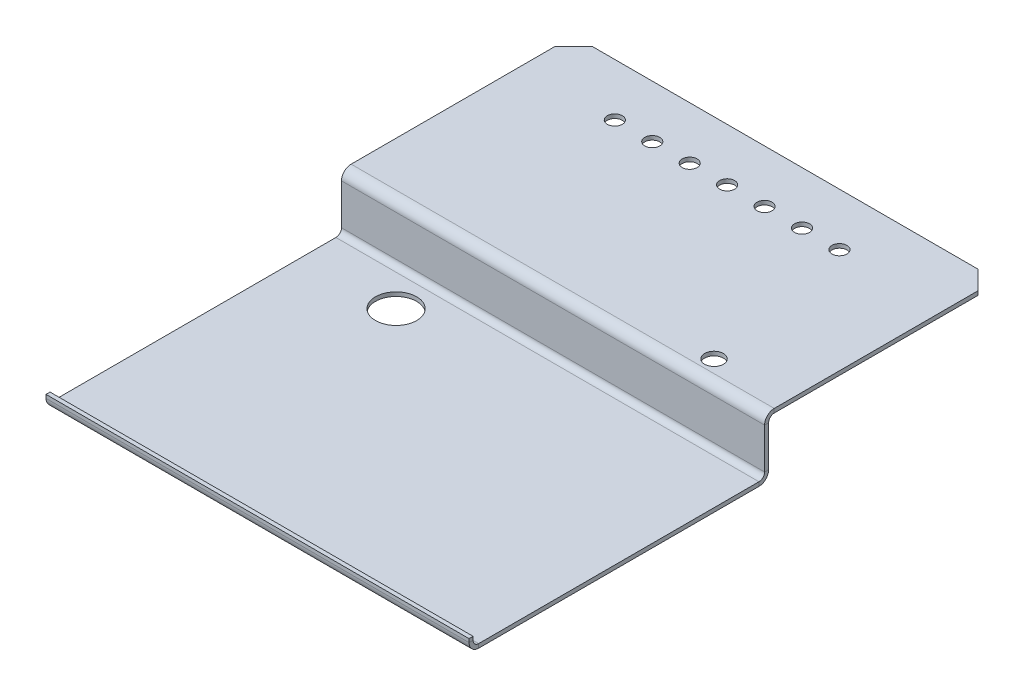
ISO-10303-21;
HEADER;
FILE_DESCRIPTION(('STEP AP214'),'2;1');
FILE_NAME('part.step','',(''),(''),'','','');
FILE_SCHEMA(('AUTOMOTIVE_DESIGN { 1 0 10303 214 1 1 1 1 }'));
ENDSEC;
DATA;
#1=APPLICATION_CONTEXT('core data for automotive mechanical design processes');
#2=APPLICATION_PROTOCOL_DEFINITION('international standard','automotive_design',2000,#1);
#3=PRODUCT_CONTEXT('',#1,'mechanical');
#4=PRODUCT('Part','Part','',(#3));
#5=PRODUCT_RELATED_PRODUCT_CATEGORY('part','',(#4));
#6=PRODUCT_DEFINITION_FORMATION('','',#4);
#7=PRODUCT_DEFINITION_CONTEXT('part definition',#1,'design');
#8=PRODUCT_DEFINITION('design','',#6,#7);
#9=PRODUCT_DEFINITION_SHAPE('','',#8);
#10=(LENGTH_UNIT() NAMED_UNIT(*) SI_UNIT(.MILLI.,.METRE.));
#11=(NAMED_UNIT(*) PLANE_ANGLE_UNIT() SI_UNIT($,.RADIAN.));
#12=(NAMED_UNIT(*) SI_UNIT($,.STERADIAN.) SOLID_ANGLE_UNIT());
#13=UNCERTAINTY_MEASURE_WITH_UNIT(LENGTH_MEASURE(1.E-05),#10,'distance_accuracy_value','');
#14=(GEOMETRIC_REPRESENTATION_CONTEXT(3) GLOBAL_UNCERTAINTY_ASSIGNED_CONTEXT((#13)) GLOBAL_UNIT_ASSIGNED_CONTEXT((#10,
#11,#12)) REPRESENTATION_CONTEXT('',''));
#15=CARTESIAN_POINT('',(0.,0.,0.));
#16=DIRECTION('',(0.,0.,1.));
#17=DIRECTION('',(1.,0.,0.));
#18=AXIS2_PLACEMENT_3D('',#15,#16,#17);
#19=CARTESIAN_POINT('',(113.,-29.85,219.85));
#20=DIRECTION('',(-1.,0.,0.));
#21=DIRECTION('',(0.,0.,1.));
#22=AXIS2_PLACEMENT_3D('',#19,#20,#21);
#23=PLANE('',#22);
#24=DIRECTION('',(0.,-1.,0.));
#25=VECTOR('',#24,1.);
#26=CARTESIAN_POINT('',(113.,-27.7,214.7));
#27=LINE('',#26,#25);
#28=CARTESIAN_POINT('',(113.,-27.7,214.7));
#29=VERTEX_POINT('',#28);
#30=CARTESIAN_POINT('',(113.,-29.85,214.7));
#31=VERTEX_POINT('',#30);
#32=EDGE_CURVE('E275',#29,#31,#27,.T.);
#33=ORIENTED_EDGE('',*,*,#32,.T.);
#34=DIRECTION('',(0.,0.,1.));
#35=VECTOR('',#34,1.);
#36=CARTESIAN_POINT('',(113.,-29.85,0.));
#37=LINE('',#36,#35);
#38=CARTESIAN_POINT('',(113.,-29.85,65.0000000000001));
#39=VERTEX_POINT('',#38);
#40=EDGE_CURVE('E294',#39,#31,#37,.T.);
#41=ORIENTED_EDGE('',*,*,#40,.F.);
#42=DIRECTION('',(0.,1.,0.));
#43=VECTOR('',#42,1.);
#44=CARTESIAN_POINT('',(113.,-27.7,65.0000000000001));
#45=LINE('',#44,#43);
#46=CARTESIAN_POINT('',(113.,-27.7,65.0000000000001));
#47=VERTEX_POINT('',#46);
#48=EDGE_CURVE('E302',#47,#39,#45,.F.);
#49=ORIENTED_EDGE('',*,*,#48,.F.);
#50=DIRECTION('',(0.,0.,-1.));
#51=VECTOR('',#50,1.);
#52=CARTESIAN_POINT('',(113.,-27.7,219.85));
#53=LINE('',#52,#51);
#54=EDGE_CURVE('E298',#47,#29,#53,.F.);
#55=ORIENTED_EDGE('',*,*,#54,.T.);
#56=EDGE_LOOP('',(#33,#41,#49,#55));
#57=FACE_BOUND('',#56,.T.);
#58=ADVANCED_FACE('F96',(#57),#23,.F.);
#59=CARTESIAN_POINT('',(-113.,-29.85,62.0000000000001));
#60=DIRECTION('',(1.,0.,0.));
#61=DIRECTION('',(0.,0.,-1.));
#62=AXIS2_PLACEMENT_3D('',#59,#60,#61);
#63=PLANE('',#62);
#64=DIRECTION('',(0.,-1.,0.));
#65=VECTOR('',#64,1.);
#66=CARTESIAN_POINT('',(-113.,-27.7,214.7));
#67=LINE('',#66,#65);
#68=CARTESIAN_POINT('',(-113.,-27.7,214.7));
#69=VERTEX_POINT('',#68);
#70=CARTESIAN_POINT('',(-113.,-29.85,214.7));
#71=VERTEX_POINT('',#70);
#72=EDGE_CURVE('E285',#69,#71,#67,.T.);
#73=ORIENTED_EDGE('',*,*,#72,.F.);
#74=DIRECTION('',(0.,0.,1.));
#75=VECTOR('',#74,1.);
#76=CARTESIAN_POINT('',(-113.,-27.7,62.0000000000001));
#77=LINE('',#76,#75);
#78=CARTESIAN_POINT('',(-113.,-27.7,65.0000000000001));
#79=VERTEX_POINT('',#78);
#80=EDGE_CURVE('E296',#69,#79,#77,.F.);
#81=ORIENTED_EDGE('',*,*,#80,.T.);
#82=DIRECTION('',(0.,1.,0.));
#83=VECTOR('',#82,1.);
#84=CARTESIAN_POINT('',(-113.,-29.85,65.0000000000001));
#85=LINE('',#84,#83);
#86=CARTESIAN_POINT('',(-113.,-29.85,65.0000000000001));
#87=VERTEX_POINT('',#86);
#88=EDGE_CURVE('E288',#79,#87,#85,.F.);
#89=ORIENTED_EDGE('',*,*,#88,.T.);
#90=DIRECTION('',(0.,0.,-1.));
#91=VECTOR('',#90,1.);
#92=CARTESIAN_POINT('',(-113.,-29.85,0.));
#93=LINE('',#92,#91);
#94=EDGE_CURVE('E291',#71,#87,#93,.T.);
#95=ORIENTED_EDGE('',*,*,#94,.F.);
#96=EDGE_LOOP('',(#73,#81,#89,#95));
#97=FACE_BOUND('',#96,.T.);
#98=ADVANCED_FACE('F463',(#97),#63,.F.);
#99=CARTESIAN_POINT('',(0.,-29.85,0.));
#100=DIRECTION('',(0.,1.,0.));
#101=DIRECTION('',(0.,0.,1.));
#102=AXIS2_PLACEMENT_3D('',#99,#100,#101);
#103=PLANE('',#102);
#104=CARTESIAN_POINT('',(-64.,-29.85,81.8500000000001));
#105=DIRECTION('',(0.,-1.,0.));
#106=DIRECTION('',(0.,0.,-1.));
#107=AXIS2_PLACEMENT_3D('',#104,#105,#106);
#108=CIRCLE('',#107,11.);
#109=CARTESIAN_POINT('',(-64.,-29.85,70.8500000000001));
#110=VERTEX_POINT('',#109);
#111=EDGE_CURVE('E404',#110,#110,#108,.T.);
#112=ORIENTED_EDGE('',*,*,#111,.F.);
#113=EDGE_LOOP('',(#112));
#114=FACE_BOUND('',#113,.T.);
#115=DIRECTION('',(1.,0.,0.));
#116=VECTOR('',#115,1.);
#117=CARTESIAN_POINT('',(113.,-29.85,214.7));
#118=LINE('',#117,#116);
#119=EDGE_CURVE('E269',#31,#71,#118,.F.);
#120=ORIENTED_EDGE('',*,*,#119,.T.);
#121=ORIENTED_EDGE('',*,*,#94,.T.);
#122=DIRECTION('',(1.,0.,0.));
#123=VECTOR('',#122,1.);
#124=CARTESIAN_POINT('',(-113.,-29.85,65.0000000000001));
#125=LINE('',#124,#123);
#126=EDGE_CURVE('E300',#39,#87,#125,.F.);
#127=ORIENTED_EDGE('',*,*,#126,.F.);
#128=ORIENTED_EDGE('',*,*,#40,.T.);
#129=EDGE_LOOP('',(#120,#121,#127,#128));
#130=FACE_BOUND('',#129,.T.);
#131=ADVANCED_FACE('F469',(#114,#130),#103,.F.);
#132=CARTESIAN_POINT('',(0.,-27.7,0.));
#133=DIRECTION('',(0.,1.,0.));
#134=DIRECTION('',(0.,0.,1.));
#135=AXIS2_PLACEMENT_3D('',#132,#133,#134);
#136=PLANE('',#135);
#137=CARTESIAN_POINT('',(-64.,-27.7,81.8500000000001));
#138=DIRECTION('',(0.,1.,0.));
#139=DIRECTION('',(0.,0.,1.));
#140=AXIS2_PLACEMENT_3D('',#137,#138,#139);
#141=CIRCLE('',#140,11.);
#142=CARTESIAN_POINT('',(-64.,-27.7,92.8500000000001));
#143=VERTEX_POINT('',#142);
#144=EDGE_CURVE('E268',#143,#143,#141,.T.);
#145=ORIENTED_EDGE('',*,*,#144,.F.);
#146=EDGE_LOOP('',(#145));
#147=FACE_BOUND('',#146,.T.);
#148=ORIENTED_EDGE('',*,*,#80,.F.);
#149=DIRECTION('',(1.,0.,0.));
#150=VECTOR('',#149,1.);
#151=CARTESIAN_POINT('',(113.,-27.7,214.7));
#152=LINE('',#151,#150);
#153=EDGE_CURVE('E113',#29,#69,#152,.F.);
#154=ORIENTED_EDGE('',*,*,#153,.F.);
#155=ORIENTED_EDGE('',*,*,#54,.F.);
#156=DIRECTION('',(1.,0.,0.));
#157=VECTOR('',#156,1.);
#158=CARTESIAN_POINT('',(-113.,-27.7,65.0000000000001));
#159=LINE('',#158,#157);
#160=EDGE_CURVE('E305',#79,#47,#159,.T.);
#161=ORIENTED_EDGE('',*,*,#160,.F.);
#162=EDGE_LOOP('',(#148,#154,#155,#161));
#163=FACE_BOUND('',#162,.T.);
#164=ADVANCED_FACE('F507',(#147,#163),#136,.T.);
#165=CARTESIAN_POINT('',(113.,0.,62.));
#166=DIRECTION('',(-1.,0.,0.));
#167=DIRECTION('',(0.,0.,1.));
#168=AXIS2_PLACEMENT_3D('',#165,#166,#167);
#169=PLANE('',#168);
#170=DIRECTION('',(0.,0.,-1.));
#171=VECTOR('',#170,1.);
#172=CARTESIAN_POINT('',(113.,-24.7,62.0000000000001));
#173=LINE('',#172,#171);
#174=CARTESIAN_POINT('',(113.,-24.7,62.0000000000001));
#175=VERTEX_POINT('',#174);
#176=CARTESIAN_POINT('',(113.,-24.7,59.8500000000001));
#177=VERTEX_POINT('',#176);
#178=EDGE_CURVE('E314',#175,#177,#173,.T.);
#179=ORIENTED_EDGE('',*,*,#178,.T.);
#180=DIRECTION('',(0.,-1.,0.));
#181=VECTOR('',#180,1.);
#182=CARTESIAN_POINT('',(113.,0.,59.85));
#183=LINE('',#182,#181);
#184=CARTESIAN_POINT('',(113.,-2.99999999999998,59.85));
#185=VERTEX_POINT('',#184);
#186=EDGE_CURVE('E338',#177,#185,#183,.F.);
#187=ORIENTED_EDGE('',*,*,#186,.T.);
#188=DIRECTION('',(0.,0.,-1.));
#189=VECTOR('',#188,1.);
#190=CARTESIAN_POINT('',(113.,-2.99999999999999,62.));
#191=LINE('',#190,#189);
#192=CARTESIAN_POINT('',(113.,-2.99999999999997,62.));
#193=VERTEX_POINT('',#192);
#194=EDGE_CURVE('E326',#185,#193,#191,.F.);
#195=ORIENTED_EDGE('',*,*,#194,.T.);
#196=DIRECTION('',(0.,1.,0.));
#197=VECTOR('',#196,1.);
#198=CARTESIAN_POINT('',(113.,2.23693329120848E-13,62.));
#199=LINE('',#198,#197);
#200=EDGE_CURVE('E333',#175,#193,#199,.T.);
#201=ORIENTED_EDGE('',*,*,#200,.F.);
#202=EDGE_LOOP('',(#179,#187,#195,#201));
#203=FACE_BOUND('',#202,.T.);
#204=ADVANCED_FACE('F503',(#203),#169,.F.);
#205=CARTESIAN_POINT('',(-113.,-29.85,62.0000000000001));
#206=DIRECTION('',(1.,0.,0.));
#207=DIRECTION('',(0.,0.,-1.));
#208=AXIS2_PLACEMENT_3D('',#205,#206,#207);
#209=PLANE('',#208);
#210=DIRECTION('',(0.,0.,-1.));
#211=VECTOR('',#210,1.);
#212=CARTESIAN_POINT('',(-113.,-24.7,62.0000000000001));
#213=LINE('',#212,#211);
#214=CARTESIAN_POINT('',(-113.,-24.7,62.0000000000001));
#215=VERTEX_POINT('',#214);
#216=CARTESIAN_POINT('',(-113.,-24.7,59.8500000000001));
#217=VERTEX_POINT('',#216);
#218=EDGE_CURVE('E324',#215,#217,#213,.T.);
#219=ORIENTED_EDGE('',*,*,#218,.F.);
#220=DIRECTION('',(0.,-1.,0.));
#221=VECTOR('',#220,1.);
#222=CARTESIAN_POINT('',(-113.,2.23693329120848E-13,62.));
#223=LINE('',#222,#221);
#224=CARTESIAN_POINT('',(-113.,-2.99999999999998,62.));
#225=VERTEX_POINT('',#224);
#226=EDGE_CURVE('E329',#225,#215,#223,.T.);
#227=ORIENTED_EDGE('',*,*,#226,.F.);
#228=DIRECTION('',(0.,0.,-1.));
#229=VECTOR('',#228,1.);
#230=CARTESIAN_POINT('',(-113.,-2.99999999999998,59.85));
#231=LINE('',#230,#229);
#232=CARTESIAN_POINT('',(-113.,-2.99999999999998,59.85));
#233=VERTEX_POINT('',#232);
#234=EDGE_CURVE('E343',#233,#225,#231,.F.);
#235=ORIENTED_EDGE('',*,*,#234,.F.);
#236=DIRECTION('',(0.,1.,0.));
#237=VECTOR('',#236,1.);
#238=CARTESIAN_POINT('',(-113.,-29.85,59.8500000000001));
#239=LINE('',#238,#237);
#240=EDGE_CURVE('E335',#233,#217,#239,.F.);
#241=ORIENTED_EDGE('',*,*,#240,.T.);
#242=EDGE_LOOP('',(#219,#227,#235,#241));
#243=FACE_BOUND('',#242,.T.);
#244=ADVANCED_FACE('F495',(#243),#209,.F.);
#245=CARTESIAN_POINT('',(0.,2.23693329120848E-13,62.));
#246=DIRECTION('',(0.,0.,-1.));
#247=DIRECTION('',(0.,1.,0.));
#248=AXIS2_PLACEMENT_3D('',#245,#246,#247);
#249=PLANE('',#248);
#250=DIRECTION('',(1.,0.,0.));
#251=VECTOR('',#250,1.);
#252=CARTESIAN_POINT('',(113.,-24.7,62.0000000000001));
#253=LINE('',#252,#251);
#254=EDGE_CURVE('E320',#175,#215,#253,.F.);
#255=ORIENTED_EDGE('',*,*,#254,.F.);
#256=ORIENTED_EDGE('',*,*,#200,.T.);
#257=DIRECTION('',(-1.,0.,0.));
#258=VECTOR('',#257,1.);
#259=CARTESIAN_POINT('',(113.,-2.99999999999999,62.));
#260=LINE('',#259,#258);
#261=EDGE_CURVE('E340',#225,#193,#260,.F.);
#262=ORIENTED_EDGE('',*,*,#261,.F.);
#263=ORIENTED_EDGE('',*,*,#226,.T.);
#264=EDGE_LOOP('',(#255,#256,#262,#263));
#265=FACE_BOUND('',#264,.T.);
#266=ADVANCED_FACE('F491',(#265),#249,.F.);
#267=CARTESIAN_POINT('',(0.,2.16186644242336E-13,59.85));
#268=DIRECTION('',(0.,0.,-1.));
#269=DIRECTION('',(0.,1.,0.));
#270=AXIS2_PLACEMENT_3D('',#267,#268,#269);
#271=PLANE('',#270);
#272=ORIENTED_EDGE('',*,*,#186,.F.);
#273=DIRECTION('',(1.,0.,0.));
#274=VECTOR('',#273,1.);
#275=CARTESIAN_POINT('',(113.,-24.7,59.8500000000001));
#276=LINE('',#275,#274);
#277=EDGE_CURVE('E309',#177,#217,#276,.F.);
#278=ORIENTED_EDGE('',*,*,#277,.T.);
#279=ORIENTED_EDGE('',*,*,#240,.F.);
#280=DIRECTION('',(-1.,0.,0.));
#281=VECTOR('',#280,1.);
#282=CARTESIAN_POINT('',(113.,-2.99999999999999,59.85));
#283=LINE('',#282,#281);
#284=EDGE_CURVE('E346',#185,#233,#283,.T.);
#285=ORIENTED_EDGE('',*,*,#284,.F.);
#286=EDGE_LOOP('',(#272,#278,#279,#285));
#287=FACE_BOUND('',#286,.T.);
#288=ADVANCED_FACE('F494',(#287),#271,.T.);
#289=CARTESIAN_POINT('',(113.,2.15,-62.));
#290=DIRECTION('',(0.,-1.,0.));
#291=DIRECTION('',(0.,0.,-1.));
#292=AXIS2_PLACEMENT_3D('',#289,#290,#291);
#293=PLANE('',#292);
#294=CARTESIAN_POINT('',(74.,2.15,50.0000000000001));
#295=DIRECTION('',(0.,1.,0.));
#296=DIRECTION('',(0.,0.,1.));
#297=AXIS2_PLACEMENT_3D('',#294,#295,#296);
#298=CIRCLE('',#297,5.00000000000001);
#299=CARTESIAN_POINT('',(74.,2.15,55.0000000000001));
#300=VERTEX_POINT('',#299);
#301=EDGE_CURVE('E968',#300,#300,#298,.T.);
#302=ORIENTED_EDGE('',*,*,#301,.F.);
#303=EDGE_LOOP('',(#302));
#304=FACE_BOUND('',#303,.T.);
#305=CARTESIAN_POINT('',(-43.,2.15,-34.));
#306=DIRECTION('',(0.,1.,0.));
#307=DIRECTION('',(0.,0.,1.));
#308=AXIS2_PLACEMENT_3D('',#305,#306,#307);
#309=CIRCLE('',#308,4.00000000000001);
#310=CARTESIAN_POINT('',(-43.,2.15,-30.));
#311=VERTEX_POINT('',#310);
#312=EDGE_CURVE('E413',#311,#311,#309,.T.);
#313=ORIENTED_EDGE('',*,*,#312,.F.);
#314=EDGE_LOOP('',(#313));
#315=FACE_BOUND('',#314,.T.);
#316=CARTESIAN_POINT('',(-23.,2.15,-34.));
#317=DIRECTION('',(0.,1.,0.));
#318=DIRECTION('',(0.,0.,1.));
#319=AXIS2_PLACEMENT_3D('',#316,#317,#318);
#320=CIRCLE('',#319,4.00000000000001);
#321=CARTESIAN_POINT('',(-23.,2.15,-30.));
#322=VERTEX_POINT('',#321);
#323=EDGE_CURVE('E973',#322,#322,#320,.T.);
#324=ORIENTED_EDGE('',*,*,#323,.F.);
#325=EDGE_LOOP('',(#324));
#326=FACE_BOUND('',#325,.T.);
#327=CARTESIAN_POINT('',(-3.,2.15,-34.));
#328=DIRECTION('',(0.,1.,0.));
#329=DIRECTION('',(0.,0.,1.));
#330=AXIS2_PLACEMENT_3D('',#327,#328,#329);
#331=CIRCLE('',#330,4.00000000000001);
#332=CARTESIAN_POINT('',(-3.,2.15,-30.));
#333=VERTEX_POINT('',#332);
#334=EDGE_CURVE('E976',#333,#333,#331,.T.);
#335=ORIENTED_EDGE('',*,*,#334,.F.);
#336=EDGE_LOOP('',(#335));
#337=FACE_BOUND('',#336,.T.);
#338=CARTESIAN_POINT('',(17.,2.15,-34.));
#339=DIRECTION('',(0.,1.,0.));
#340=DIRECTION('',(0.,0.,1.));
#341=AXIS2_PLACEMENT_3D('',#338,#339,#340);
#342=CIRCLE('',#341,4.00000000000001);
#343=CARTESIAN_POINT('',(17.,2.15,-30.));
#344=VERTEX_POINT('',#343);
#345=EDGE_CURVE('E979',#344,#344,#342,.T.);
#346=ORIENTED_EDGE('',*,*,#345,.F.);
#347=EDGE_LOOP('',(#346));
#348=FACE_BOUND('',#347,.T.);
#349=CARTESIAN_POINT('',(37.,2.15,-34.));
#350=DIRECTION('',(0.,1.,0.));
#351=DIRECTION('',(0.,0.,1.));
#352=AXIS2_PLACEMENT_3D('',#349,#350,#351);
#353=CIRCLE('',#352,4.00000000000001);
#354=CARTESIAN_POINT('',(37.,2.15,-30.));
#355=VERTEX_POINT('',#354);
#356=EDGE_CURVE('E981',#355,#355,#353,.T.);
#357=ORIENTED_EDGE('',*,*,#356,.F.);
#358=EDGE_LOOP('',(#357));
#359=FACE_BOUND('',#358,.T.);
#360=CARTESIAN_POINT('',(57.,2.15,-34.));
#361=DIRECTION('',(0.,1.,0.));
#362=DIRECTION('',(0.,0.,1.));
#363=AXIS2_PLACEMENT_3D('',#360,#361,#362);
#364=CIRCLE('',#363,4.00000000000001);
#365=CARTESIAN_POINT('',(57.,2.15,-30.));
#366=VERTEX_POINT('',#365);
#367=EDGE_CURVE('E434',#366,#366,#364,.T.);
#368=ORIENTED_EDGE('',*,*,#367,.F.);
#369=EDGE_LOOP('',(#368));
#370=FACE_BOUND('',#369,.T.);
#371=CARTESIAN_POINT('',(-63.,2.15,-34.));
#372=DIRECTION('',(0.,1.,0.));
#373=DIRECTION('',(0.,0.,1.));
#374=AXIS2_PLACEMENT_3D('',#371,#372,#373);
#375=CIRCLE('',#374,4.00000000000001);
#376=CARTESIAN_POINT('',(-63.,2.15,-30.));
#377=VERTEX_POINT('',#376);
#378=EDGE_CURVE('E408',#377,#377,#375,.T.);
#379=ORIENTED_EDGE('',*,*,#378,.F.);
#380=EDGE_LOOP('',(#379));
#381=FACE_BOUND('',#380,.T.);
#382=DIRECTION('',(-1.,0.,0.));
#383=VECTOR('',#382,1.);
#384=CARTESIAN_POINT('',(-113.,2.14999999999996,56.85));
#385=LINE('',#384,#383);
#386=CARTESIAN_POINT('',(-113.,2.14999999999996,56.85));
#387=VERTEX_POINT('',#386);
#388=CARTESIAN_POINT('',(113.,2.15,56.85));
#389=VERTEX_POINT('',#388);
#390=EDGE_CURVE('E350',#387,#389,#385,.F.);
#391=ORIENTED_EDGE('',*,*,#390,.T.);
#392=DIRECTION('',(0.,0.,-1.));
#393=VECTOR('',#392,1.);
#394=CARTESIAN_POINT('',(113.,2.15,-62.));
#395=LINE('',#394,#393);
#396=CARTESIAN_POINT('',(113.,2.15,-51.9999999999999));
#397=VERTEX_POINT('',#396);
#398=EDGE_CURVE('E373',#397,#389,#395,.F.);
#399=ORIENTED_EDGE('',*,*,#398,.F.);
#400=DIRECTION('',(0.707106781186546,0.,0.707106781186549));
#401=VECTOR('',#400,1.);
#402=CARTESIAN_POINT('',(103.,2.15,-62.));
#403=LINE('',#402,#401);
#404=CARTESIAN_POINT('',(103.,2.15,-62.));
#405=VERTEX_POINT('',#404);
#406=EDGE_CURVE('E105',#397,#405,#403,.F.);
#407=ORIENTED_EDGE('',*,*,#406,.T.);
#408=DIRECTION('',(-1.,0.,0.));
#409=VECTOR('',#408,1.);
#410=CARTESIAN_POINT('',(113.,2.15,-62.));
#411=LINE('',#410,#409);
#412=CARTESIAN_POINT('',(-103.,2.15,-62.));
#413=VERTEX_POINT('',#412);
#414=EDGE_CURVE('E380',#405,#413,#411,.T.);
#415=ORIENTED_EDGE('',*,*,#414,.T.);
#416=DIRECTION('',(-0.70710678118655,0.,0.707106781186546));
#417=VECTOR('',#416,1.);
#418=CARTESIAN_POINT('',(-113.,2.15,-52.));
#419=LINE('',#418,#417);
#420=CARTESIAN_POINT('',(-113.,2.15,-52.));
#421=VERTEX_POINT('',#420);
#422=EDGE_CURVE('E399',#413,#421,#419,.T.);
#423=ORIENTED_EDGE('',*,*,#422,.T.);
#424=DIRECTION('',(0.,0.,-1.));
#425=VECTOR('',#424,1.);
#426=CARTESIAN_POINT('',(-113.,2.15,-62.));
#427=LINE('',#426,#425);
#428=EDGE_CURVE('E370',#421,#387,#427,.F.);
#429=ORIENTED_EDGE('',*,*,#428,.T.);
#430=EDGE_LOOP('',(#391,#399,#407,#415,#423,#429));
#431=FACE_BOUND('',#430,.T.);
#432=ADVANCED_FACE('F499',(#304,#315,#326,#337,#348,#359,#370,#381,#431),#293,.F.);
#433=CARTESIAN_POINT('',(113.,0.,-62.));
#434=DIRECTION('',(0.,-1.,0.));
#435=DIRECTION('',(0.,0.,-1.));
#436=AXIS2_PLACEMENT_3D('',#433,#434,#435);
#437=PLANE('',#436);
#438=CARTESIAN_POINT('',(74.,0.,50.0000000000001));
#439=DIRECTION('',(0.,-1.,0.));
#440=DIRECTION('',(0.,0.,-1.));
#441=AXIS2_PLACEMENT_3D('',#438,#439,#440);
#442=CIRCLE('',#441,5.00000000000001);
#443=CARTESIAN_POINT('',(74.,0.,45.0000000000001));
#444=VERTEX_POINT('',#443);
#445=EDGE_CURVE('E100',#444,#444,#442,.T.);
#446=ORIENTED_EDGE('',*,*,#445,.F.);
#447=EDGE_LOOP('',(#446));
#448=FACE_BOUND('',#447,.T.);
#449=CARTESIAN_POINT('',(-43.,0.,-34.));
#450=DIRECTION('',(0.,-1.,0.));
#451=DIRECTION('',(0.,0.,-1.));
#452=AXIS2_PLACEMENT_3D('',#449,#450,#451);
#453=CIRCLE('',#452,4.00000000000001);
#454=CARTESIAN_POINT('',(-43.,0.,-38.));
#455=VERTEX_POINT('',#454);
#456=EDGE_CURVE('E424',#455,#455,#453,.T.);
#457=ORIENTED_EDGE('',*,*,#456,.F.);
#458=EDGE_LOOP('',(#457));
#459=FACE_BOUND('',#458,.T.);
#460=CARTESIAN_POINT('',(-23.,0.,-34.));
#461=DIRECTION('',(0.,-1.,0.));
#462=DIRECTION('',(0.,0.,-1.));
#463=AXIS2_PLACEMENT_3D('',#460,#461,#462);
#464=CIRCLE('',#463,4.00000000000001);
#465=CARTESIAN_POINT('',(-23.,0.,-38.));
#466=VERTEX_POINT('',#465);
#467=EDGE_CURVE('E422',#466,#466,#464,.T.);
#468=ORIENTED_EDGE('',*,*,#467,.F.);
#469=EDGE_LOOP('',(#468));
#470=FACE_BOUND('',#469,.T.);
#471=CARTESIAN_POINT('',(-3.,0.,-34.));
#472=DIRECTION('',(0.,-1.,0.));
#473=DIRECTION('',(0.,0.,-1.));
#474=AXIS2_PLACEMENT_3D('',#471,#472,#473);
#475=CIRCLE('',#474,4.00000000000001);
#476=CARTESIAN_POINT('',(-3.,0.,-38.));
#477=VERTEX_POINT('',#476);
#478=EDGE_CURVE('E419',#477,#477,#475,.T.);
#479=ORIENTED_EDGE('',*,*,#478,.F.);
#480=EDGE_LOOP('',(#479));
#481=FACE_BOUND('',#480,.T.);
#482=CARTESIAN_POINT('',(17.,0.,-34.));
#483=DIRECTION('',(0.,-1.,0.));
#484=DIRECTION('',(0.,0.,-1.));
#485=AXIS2_PLACEMENT_3D('',#482,#483,#484);
#486=CIRCLE('',#485,4.00000000000001);
#487=CARTESIAN_POINT('',(17.,0.,-38.));
#488=VERTEX_POINT('',#487);
#489=EDGE_CURVE('E416',#488,#488,#486,.T.);
#490=ORIENTED_EDGE('',*,*,#489,.F.);
#491=EDGE_LOOP('',(#490));
#492=FACE_BOUND('',#491,.T.);
#493=CARTESIAN_POINT('',(37.,0.,-34.));
#494=DIRECTION('',(0.,-1.,0.));
#495=DIRECTION('',(0.,0.,-1.));
#496=AXIS2_PLACEMENT_3D('',#493,#494,#495);
#497=CIRCLE('',#496,4.00000000000001);
#498=CARTESIAN_POINT('',(37.,0.,-38.));
#499=VERTEX_POINT('',#498);
#500=EDGE_CURVE('E412',#499,#499,#497,.T.);
#501=ORIENTED_EDGE('',*,*,#500,.F.);
#502=EDGE_LOOP('',(#501));
#503=FACE_BOUND('',#502,.T.);
#504=CARTESIAN_POINT('',(57.,0.,-34.));
#505=DIRECTION('',(0.,-1.,0.));
#506=DIRECTION('',(0.,0.,-1.));
#507=AXIS2_PLACEMENT_3D('',#504,#505,#506);
#508=CIRCLE('',#507,4.00000000000001);
#509=CARTESIAN_POINT('',(57.,0.,-38.));
#510=VERTEX_POINT('',#509);
#511=EDGE_CURVE('E409',#510,#510,#508,.T.);
#512=ORIENTED_EDGE('',*,*,#511,.F.);
#513=EDGE_LOOP('',(#512));
#514=FACE_BOUND('',#513,.T.);
#515=CARTESIAN_POINT('',(-63.,0.,-34.));
#516=DIRECTION('',(0.,-1.,0.));
#517=DIRECTION('',(0.,0.,-1.));
#518=AXIS2_PLACEMENT_3D('',#515,#516,#517);
#519=CIRCLE('',#518,4.00000000000001);
#520=CARTESIAN_POINT('',(-63.,0.,-38.));
#521=VERTEX_POINT('',#520);
#522=EDGE_CURVE('E405',#521,#521,#519,.T.);
#523=ORIENTED_EDGE('',*,*,#522,.F.);
#524=EDGE_LOOP('',(#523));
#525=FACE_BOUND('',#524,.T.);
#526=DIRECTION('',(0.,0.,1.));
#527=VECTOR('',#526,1.);
#528=CARTESIAN_POINT('',(113.,0.,-62.));
#529=LINE('',#528,#527);
#530=CARTESIAN_POINT('',(113.,0.,-51.9999999999999));
#531=VERTEX_POINT('',#530);
#532=CARTESIAN_POINT('',(113.,0.,56.85));
#533=VERTEX_POINT('',#532);
#534=EDGE_CURVE('E376',#531,#533,#529,.T.);
#535=ORIENTED_EDGE('',*,*,#534,.T.);
#536=DIRECTION('',(-1.,0.,0.));
#537=VECTOR('',#536,1.);
#538=CARTESIAN_POINT('',(-113.,0.,56.85));
#539=LINE('',#538,#537);
#540=CARTESIAN_POINT('',(-113.,0.,56.85));
#541=VERTEX_POINT('',#540);
#542=EDGE_CURVE('E362',#541,#533,#539,.F.);
#543=ORIENTED_EDGE('',*,*,#542,.F.);
#544=DIRECTION('',(0.,0.,1.));
#545=VECTOR('',#544,1.);
#546=CARTESIAN_POINT('',(-113.,0.,-62.));
#547=LINE('',#546,#545);
#548=CARTESIAN_POINT('',(-113.,0.,-52.));
#549=VERTEX_POINT('',#548);
#550=EDGE_CURVE('E377',#549,#541,#547,.T.);
#551=ORIENTED_EDGE('',*,*,#550,.F.);
#552=DIRECTION('',(0.70710678118655,0.,-0.707106781186546));
#553=VECTOR('',#552,1.);
#554=CARTESIAN_POINT('',(5.00000000000063,0.,-170.));
#555=LINE('',#554,#553);
#556=CARTESIAN_POINT('',(-103.,0.,-62.));
#557=VERTEX_POINT('',#556);
#558=EDGE_CURVE('E393',#549,#557,#555,.T.);
#559=ORIENTED_EDGE('',*,*,#558,.T.);
#560=DIRECTION('',(-1.,0.,0.));
#561=VECTOR('',#560,1.);
#562=CARTESIAN_POINT('',(113.,0.,-62.));
#563=LINE('',#562,#561);
#564=CARTESIAN_POINT('',(103.,0.,-62.));
#565=VERTEX_POINT('',#564);
#566=EDGE_CURVE('E385',#565,#557,#563,.T.);
#567=ORIENTED_EDGE('',*,*,#566,.F.);
#568=DIRECTION('',(-0.707106781186546,0.,-0.707106781186549));
#569=VECTOR('',#568,1.);
#570=CARTESIAN_POINT('',(108.,0.,-57.));
#571=LINE('',#570,#569);
#572=EDGE_CURVE('E395',#565,#531,#571,.F.);
#573=ORIENTED_EDGE('',*,*,#572,.T.);
#574=EDGE_LOOP('',(#535,#543,#551,#559,#567,#573));
#575=FACE_BOUND('',#574,.T.);
#576=ADVANCED_FACE('F533',(#448,#459,#470,#481,#492,#503,#514,#525,#575),#437,.T.);
#577=CARTESIAN_POINT('',(-113.,0.,0.));
#578=DIRECTION('',(1.,0.,0.));
#579=DIRECTION('',(0.,-1.,0.));
#580=AXIS2_PLACEMENT_3D('',#577,#578,#579);
#581=PLANE('',#580);
#582=DIRECTION('',(0.,1.,0.));
#583=VECTOR('',#582,1.);
#584=CARTESIAN_POINT('',(-113.,0.,56.85));
#585=LINE('',#584,#583);
#586=EDGE_CURVE('E356',#541,#387,#585,.T.);
#587=ORIENTED_EDGE('',*,*,#586,.T.);
#588=ORIENTED_EDGE('',*,*,#428,.F.);
#589=DIRECTION('',(0.,-1.,0.));
#590=VECTOR('',#589,1.);
#591=CARTESIAN_POINT('',(-113.,0.,-52.));
#592=LINE('',#591,#590);
#593=EDGE_CURVE('E13',#421,#549,#592,.T.);
#594=ORIENTED_EDGE('',*,*,#593,.T.);
#595=ORIENTED_EDGE('',*,*,#550,.T.);
#596=EDGE_LOOP('',(#587,#588,#594,#595));
#597=FACE_BOUND('',#596,.T.);
#598=ADVANCED_FACE('F530',(#597),#581,.F.);
#599=CARTESIAN_POINT('',(113.,2.15,-62.));
#600=DIRECTION('',(0.,0.,-1.));
#601=DIRECTION('',(-1.,0.,0.));
#602=AXIS2_PLACEMENT_3D('',#599,#600,#601);
#603=PLANE('',#602);
#604=ORIENTED_EDGE('',*,*,#414,.F.);
#605=DIRECTION('',(0.,-1.,0.));
#606=VECTOR('',#605,1.);
#607=CARTESIAN_POINT('',(103.,2.15,-62.));
#608=LINE('',#607,#606);
#609=EDGE_CURVE('E390',#405,#565,#608,.T.);
#610=ORIENTED_EDGE('',*,*,#609,.T.);
#611=ORIENTED_EDGE('',*,*,#566,.T.);
#612=DIRECTION('',(0.,1.,0.));
#613=VECTOR('',#612,1.);
#614=CARTESIAN_POINT('',(-103.,2.15,-62.));
#615=LINE('',#614,#613);
#616=EDGE_CURVE('E388',#557,#413,#615,.T.);
#617=ORIENTED_EDGE('',*,*,#616,.T.);
#618=EDGE_LOOP('',(#604,#610,#611,#617));
#619=FACE_BOUND('',#618,.T.);
#620=ADVANCED_FACE('F528',(#619),#603,.T.);
#621=CARTESIAN_POINT('',(113.,0.,0.));
#622=DIRECTION('',(1.,0.,0.));
#623=DIRECTION('',(0.,-1.,0.));
#624=AXIS2_PLACEMENT_3D('',#621,#622,#623);
#625=PLANE('',#624);
#626=DIRECTION('',(0.,1.,0.));
#627=VECTOR('',#626,1.);
#628=CARTESIAN_POINT('',(113.,0.,56.85));
#629=LINE('',#628,#627);
#630=EDGE_CURVE('E367',#533,#389,#629,.T.);
#631=ORIENTED_EDGE('',*,*,#630,.F.);
#632=ORIENTED_EDGE('',*,*,#534,.F.);
#633=DIRECTION('',(0.,1.,0.));
#634=VECTOR('',#633,1.);
#635=CARTESIAN_POINT('',(113.,0.,-51.9999999999999));
#636=LINE('',#635,#634);
#637=EDGE_CURVE('E397',#531,#397,#636,.T.);
#638=ORIENTED_EDGE('',*,*,#637,.T.);
#639=ORIENTED_EDGE('',*,*,#398,.T.);
#640=EDGE_LOOP('',(#631,#632,#638,#639));
#641=FACE_BOUND('',#640,.T.);
#642=ADVANCED_FACE('F524',(#641),#625,.T.);
#643=CARTESIAN_POINT('',(103.,2.15,-62.));
#644=DIRECTION('',(-0.707106781186549,0.,0.707106781186545));
#645=DIRECTION('',(0.,-1.,0.));
#646=AXIS2_PLACEMENT_3D('',#643,#644,#645);
#647=PLANE('',#646);
#648=ORIENTED_EDGE('',*,*,#406,.F.);
#649=ORIENTED_EDGE('',*,*,#637,.F.);
#650=ORIENTED_EDGE('',*,*,#572,.F.);
#651=ORIENTED_EDGE('',*,*,#609,.F.);
#652=EDGE_LOOP('',(#648,#649,#650,#651));
#653=FACE_BOUND('',#652,.T.);
#654=ADVANCED_FACE('F527',(#653),#647,.F.);
#655=CARTESIAN_POINT('',(-113.,0.,-52.));
#656=DIRECTION('',(-0.707106781186545,0.,-0.707106781186549));
#657=DIRECTION('',(0.,1.,0.));
#658=AXIS2_PLACEMENT_3D('',#655,#656,#657);
#659=PLANE('',#658);
#660=ORIENTED_EDGE('',*,*,#422,.F.);
#661=ORIENTED_EDGE('',*,*,#616,.F.);
#662=ORIENTED_EDGE('',*,*,#558,.F.);
#663=ORIENTED_EDGE('',*,*,#593,.F.);
#664=EDGE_LOOP('',(#660,#661,#662,#663));
#665=FACE_BOUND('',#664,.T.);
#666=ADVANCED_FACE('F98',(#665),#659,.T.);
#667=CARTESIAN_POINT('',(113.,-2.99999999999999,56.8500000000001));
#668=DIRECTION('',(1.,0.,0.));
#669=DIRECTION('',(0.,0.,-1.));
#670=AXIS2_PLACEMENT_3D('',#667,#668,#669);
#671=PLANE('',#670);
#672=ORIENTED_EDGE('',*,*,#194,.F.);
#673=CARTESIAN_POINT('',(113.,-2.99999999999999,56.8500000000001));
#674=DIRECTION('',(-1.,0.,0.));
#675=DIRECTION('',(0.,0.,1.));
#676=AXIS2_PLACEMENT_3D('',#673,#674,#675);
#677=CIRCLE('',#676,2.99999999999995);
#678=EDGE_CURVE('E359',#533,#185,#677,.F.);
#679=ORIENTED_EDGE('',*,*,#678,.F.);
#680=ORIENTED_EDGE('',*,*,#630,.T.);
#681=CARTESIAN_POINT('',(113.,-2.99999999999999,56.8500000000001));
#682=DIRECTION('',(-1.,0.,0.));
#683=DIRECTION('',(0.,0.,1.));
#684=AXIS2_PLACEMENT_3D('',#681,#682,#683);
#685=CIRCLE('',#684,5.14999999999995);
#686=EDGE_CURVE('E352',#389,#193,#685,.F.);
#687=ORIENTED_EDGE('',*,*,#686,.T.);
#688=EDGE_LOOP('',(#672,#679,#680,#687));
#689=FACE_BOUND('',#688,.T.);
#690=ADVANCED_FACE('F517',(#689),#671,.T.);
#691=CARTESIAN_POINT('',(-113.,-2.99999999999999,56.8500000000001));
#692=DIRECTION('',(1.,0.,0.));
#693=DIRECTION('',(0.,0.,-1.));
#694=AXIS2_PLACEMENT_3D('',#691,#692,#693);
#695=PLANE('',#694);
#696=CARTESIAN_POINT('',(-113.,-2.99999999999999,56.8500000000001));
#697=DIRECTION('',(-1.,0.,0.));
#698=DIRECTION('',(0.,0.,1.));
#699=AXIS2_PLACEMENT_3D('',#696,#697,#698);
#700=CIRCLE('',#699,2.99999999999995);
#701=EDGE_CURVE('E332',#233,#541,#700,.T.);
#702=ORIENTED_EDGE('',*,*,#701,.F.);
#703=ORIENTED_EDGE('',*,*,#234,.T.);
#704=CARTESIAN_POINT('',(-113.,-2.99999999999999,56.8500000000001));
#705=DIRECTION('',(-1.,0.,0.));
#706=DIRECTION('',(0.,0.,1.));
#707=AXIS2_PLACEMENT_3D('',#704,#705,#706);
#708=CIRCLE('',#707,5.14999999999995);
#709=EDGE_CURVE('E353',#225,#387,#708,.T.);
#710=ORIENTED_EDGE('',*,*,#709,.T.);
#711=ORIENTED_EDGE('',*,*,#586,.F.);
#712=EDGE_LOOP('',(#702,#703,#710,#711));
#713=FACE_BOUND('',#712,.T.);
#714=ADVANCED_FACE('F512',(#713),#695,.F.);
#715=CARTESIAN_POINT('',(-113.,-2.99999999999999,56.8500000000001));
#716=DIRECTION('',(-1.,0.,0.));
#717=DIRECTION('',(0.,0.,1.));
#718=AXIS2_PLACEMENT_3D('',#715,#716,#717);
#719=CYLINDRICAL_SURFACE('',#718,5.14999999999995);
#720=ORIENTED_EDGE('',*,*,#390,.F.);
#721=ORIENTED_EDGE('',*,*,#709,.F.);
#722=ORIENTED_EDGE('',*,*,#261,.T.);
#723=ORIENTED_EDGE('',*,*,#686,.F.);
#724=EDGE_LOOP('',(#720,#721,#722,#723));
#725=FACE_BOUND('',#724,.T.);
#726=ADVANCED_FACE('F509',(#725),#719,.T.);
#727=CARTESIAN_POINT('',(-113.,-2.99999999999999,56.8500000000001));
#728=DIRECTION('',(-1.,0.,0.));
#729=DIRECTION('',(0.,0.,1.));
#730=AXIS2_PLACEMENT_3D('',#727,#728,#729);
#731=CYLINDRICAL_SURFACE('',#730,2.99999999999995);
#732=ORIENTED_EDGE('',*,*,#542,.T.);
#733=ORIENTED_EDGE('',*,*,#678,.T.);
#734=ORIENTED_EDGE('',*,*,#284,.T.);
#735=ORIENTED_EDGE('',*,*,#701,.T.);
#736=EDGE_LOOP('',(#732,#733,#734,#735));
#737=FACE_BOUND('',#736,.T.);
#738=ADVANCED_FACE('F486',(#737),#731,.F.);
#739=CARTESIAN_POINT('',(-113.,-24.7,65.0000000000001));
#740=DIRECTION('',(-1.,0.,0.));
#741=DIRECTION('',(0.,0.,1.));
#742=AXIS2_PLACEMENT_3D('',#739,#740,#741);
#743=PLANE('',#742);
#744=ORIENTED_EDGE('',*,*,#88,.F.);
#745=CARTESIAN_POINT('',(-113.,-24.7,65.0000000000001));
#746=DIRECTION('',(1.,0.,0.));
#747=DIRECTION('',(0.,0.,-1.));
#748=AXIS2_PLACEMENT_3D('',#745,#746,#747);
#749=CIRCLE('',#748,3.);
#750=EDGE_CURVE('E317',#215,#79,#749,.F.);
#751=ORIENTED_EDGE('',*,*,#750,.F.);
#752=ORIENTED_EDGE('',*,*,#218,.T.);
#753=CARTESIAN_POINT('',(-113.,-24.7,65.0000000000001));
#754=DIRECTION('',(1.,0.,0.));
#755=DIRECTION('',(0.,0.,-1.));
#756=AXIS2_PLACEMENT_3D('',#753,#754,#755);
#757=CIRCLE('',#756,5.15);
#758=EDGE_CURVE('E121',#217,#87,#757,.F.);
#759=ORIENTED_EDGE('',*,*,#758,.T.);
#760=EDGE_LOOP('',(#744,#751,#752,#759));
#761=FACE_BOUND('',#760,.T.);
#762=ADVANCED_FACE('F483',(#761),#743,.T.);
#763=CARTESIAN_POINT('',(113.,-24.7,65.0000000000001));
#764=DIRECTION('',(-1.,0.,0.));
#765=DIRECTION('',(0.,0.,1.));
#766=AXIS2_PLACEMENT_3D('',#763,#764,#765);
#767=PLANE('',#766);
#768=CARTESIAN_POINT('',(113.,-24.7,65.0000000000001));
#769=DIRECTION('',(1.,0.,0.));
#770=DIRECTION('',(0.,0.,-1.));
#771=AXIS2_PLACEMENT_3D('',#768,#769,#770);
#772=CIRCLE('',#771,3.);
#773=EDGE_CURVE('E293',#47,#175,#772,.T.);
#774=ORIENTED_EDGE('',*,*,#773,.F.);
#775=ORIENTED_EDGE('',*,*,#48,.T.);
#776=CARTESIAN_POINT('',(113.,-24.7,65.0000000000001));
#777=DIRECTION('',(1.,0.,0.));
#778=DIRECTION('',(0.,0.,-1.));
#779=AXIS2_PLACEMENT_3D('',#776,#777,#778);
#780=CIRCLE('',#779,5.15);
#781=EDGE_CURVE('E312',#39,#177,#780,.T.);
#782=ORIENTED_EDGE('',*,*,#781,.T.);
#783=ORIENTED_EDGE('',*,*,#178,.F.);
#784=EDGE_LOOP('',(#774,#775,#782,#783));
#785=FACE_BOUND('',#784,.T.);
#786=ADVANCED_FACE('F478',(#785),#767,.F.);
#787=CARTESIAN_POINT('',(113.,-24.7,65.0000000000001));
#788=DIRECTION('',(1.,0.,0.));
#789=DIRECTION('',(0.,-1.,0.));
#790=AXIS2_PLACEMENT_3D('',#787,#788,#789);
#791=CYLINDRICAL_SURFACE('',#790,5.15);
#792=ORIENTED_EDGE('',*,*,#277,.F.);
#793=ORIENTED_EDGE('',*,*,#781,.F.);
#794=ORIENTED_EDGE('',*,*,#126,.T.);
#795=ORIENTED_EDGE('',*,*,#758,.F.);
#796=EDGE_LOOP('',(#792,#793,#794,#795));
#797=FACE_BOUND('',#796,.T.);
#798=ADVANCED_FACE('F474',(#797),#791,.T.);
#799=CARTESIAN_POINT('',(113.,-24.7,65.0000000000001));
#800=DIRECTION('',(1.,0.,0.));
#801=DIRECTION('',(0.,-1.,0.));
#802=AXIS2_PLACEMENT_3D('',#799,#800,#801);
#803=CYLINDRICAL_SURFACE('',#802,3.);
#804=ORIENTED_EDGE('',*,*,#254,.T.);
#805=ORIENTED_EDGE('',*,*,#750,.T.);
#806=ORIENTED_EDGE('',*,*,#160,.T.);
#807=ORIENTED_EDGE('',*,*,#773,.T.);
#808=EDGE_LOOP('',(#804,#805,#806,#807));
#809=FACE_BOUND('',#808,.T.);
#810=ADVANCED_FACE('F477',(#809),#803,.F.);
#811=CARTESIAN_POINT('',(-113.,-24.7,214.7));
#812=DIRECTION('',(-1.,0.,0.));
#813=DIRECTION('',(0.,0.,1.));
#814=AXIS2_PLACEMENT_3D('',#811,#812,#813);
#815=PLANE('',#814);
#816=DIRECTION('',(0.,0.,-1.));
#817=VECTOR('',#816,1.);
#818=CARTESIAN_POINT('',(-113.,-24.7,219.85));
#819=LINE('',#818,#817);
#820=CARTESIAN_POINT('',(-113.,-24.7,217.7));
#821=VERTEX_POINT('',#820);
#822=CARTESIAN_POINT('',(-113.,-24.7,219.85));
#823=VERTEX_POINT('',#822);
#824=EDGE_CURVE('E250',#821,#823,#819,.F.);
#825=ORIENTED_EDGE('',*,*,#824,.F.);
#826=CARTESIAN_POINT('',(-113.,-24.7,214.7));
#827=DIRECTION('',(1.,0.,0.));
#828=DIRECTION('',(0.,0.,-1.));
#829=AXIS2_PLACEMENT_3D('',#826,#827,#828);
#830=CIRCLE('',#829,3.);
#831=EDGE_CURVE('E278',#69,#821,#830,.F.);
#832=ORIENTED_EDGE('',*,*,#831,.F.);
#833=ORIENTED_EDGE('',*,*,#72,.T.);
#834=CARTESIAN_POINT('',(-113.,-24.7,214.7));
#835=DIRECTION('',(1.,0.,0.));
#836=DIRECTION('',(0.,0.,-1.));
#837=AXIS2_PLACEMENT_3D('',#834,#835,#836);
#838=CIRCLE('',#837,5.15);
#839=EDGE_CURVE('E271',#71,#823,#838,.F.);
#840=ORIENTED_EDGE('',*,*,#839,.T.);
#841=EDGE_LOOP('',(#825,#832,#833,#840));
#842=FACE_BOUND('',#841,.T.);
#843=ADVANCED_FACE('F481',(#842),#815,.T.);
#844=CARTESIAN_POINT('',(113.,-24.7,214.7));
#845=DIRECTION('',(-1.,0.,0.));
#846=DIRECTION('',(0.,0.,1.));
#847=AXIS2_PLACEMENT_3D('',#844,#845,#846);
#848=PLANE('',#847);
#849=CARTESIAN_POINT('',(113.,-24.7,214.7));
#850=DIRECTION('',(1.,0.,0.));
#851=DIRECTION('',(0.,0.,-1.));
#852=AXIS2_PLACEMENT_3D('',#849,#850,#851);
#853=CIRCLE('',#852,3.);
#854=CARTESIAN_POINT('',(113.,-24.7,217.7));
#855=VERTEX_POINT('',#854);
#856=EDGE_CURVE('E282',#855,#29,#853,.T.);
#857=ORIENTED_EDGE('',*,*,#856,.F.);
#858=DIRECTION('',(0.,0.,-1.));
#859=VECTOR('',#858,1.);
#860=CARTESIAN_POINT('',(113.,-24.7,217.7));
#861=LINE('',#860,#859);
#862=CARTESIAN_POINT('',(113.,-24.7,219.85));
#863=VERTEX_POINT('',#862);
#864=EDGE_CURVE('E262',#855,#863,#861,.F.);
#865=ORIENTED_EDGE('',*,*,#864,.T.);
#866=CARTESIAN_POINT('',(113.,-24.7,214.7));
#867=DIRECTION('',(1.,0.,0.));
#868=DIRECTION('',(0.,0.,-1.));
#869=AXIS2_PLACEMENT_3D('',#866,#867,#868);
#870=CIRCLE('',#869,5.15);
#871=EDGE_CURVE('E272',#863,#31,#870,.T.);
#872=ORIENTED_EDGE('',*,*,#871,.T.);
#873=ORIENTED_EDGE('',*,*,#32,.F.);
#874=EDGE_LOOP('',(#857,#865,#872,#873));
#875=FACE_BOUND('',#874,.T.);
#876=ADVANCED_FACE('F449',(#875),#848,.F.);
#877=CARTESIAN_POINT('',(113.,-24.7,214.7));
#878=DIRECTION('',(1.,0.,0.));
#879=DIRECTION('',(0.,0.,1.));
#880=AXIS2_PLACEMENT_3D('',#877,#878,#879);
#881=CYLINDRICAL_SURFACE('',#880,5.15);
#882=ORIENTED_EDGE('',*,*,#119,.F.);
#883=ORIENTED_EDGE('',*,*,#871,.F.);
#884=DIRECTION('',(1.,0.,0.));
#885=VECTOR('',#884,1.);
#886=CARTESIAN_POINT('',(-113.,-24.7,219.85));
#887=LINE('',#886,#885);
#888=EDGE_CURVE('E260',#863,#823,#887,.F.);
#889=ORIENTED_EDGE('',*,*,#888,.T.);
#890=ORIENTED_EDGE('',*,*,#839,.F.);
#891=EDGE_LOOP('',(#882,#883,#889,#890));
#892=FACE_BOUND('',#891,.T.);
#893=ADVANCED_FACE('F458',(#892),#881,.T.);
#894=CARTESIAN_POINT('',(113.,-24.7,214.7));
#895=DIRECTION('',(1.,0.,0.));
#896=DIRECTION('',(0.,0.,1.));
#897=AXIS2_PLACEMENT_3D('',#894,#895,#896);
#898=CYLINDRICAL_SURFACE('',#897,3.);
#899=ORIENTED_EDGE('',*,*,#153,.T.);
#900=ORIENTED_EDGE('',*,*,#831,.T.);
#901=DIRECTION('',(1.,0.,0.));
#902=VECTOR('',#901,1.);
#903=CARTESIAN_POINT('',(-113.,-24.7,217.7));
#904=LINE('',#903,#902);
#905=EDGE_CURVE('E265',#821,#855,#904,.T.);
#906=ORIENTED_EDGE('',*,*,#905,.T.);
#907=ORIENTED_EDGE('',*,*,#856,.T.);
#908=EDGE_LOOP('',(#899,#900,#906,#907));
#909=FACE_BOUND('',#908,.T.);
#910=ADVANCED_FACE('F444',(#909),#898,.F.);
#911=CARTESIAN_POINT('',(113.,-22.85,219.85));
#912=DIRECTION('',(-1.,0.,0.));
#913=DIRECTION('',(0.,0.,1.));
#914=AXIS2_PLACEMENT_3D('',#911,#912,#913);
#915=PLANE('',#914);
#916=ORIENTED_EDGE('',*,*,#864,.F.);
#917=DIRECTION('',(0.,-1.,0.));
#918=VECTOR('',#917,1.);
#919=CARTESIAN_POINT('',(113.,-22.85,217.7));
#920=LINE('',#919,#918);
#921=CARTESIAN_POINT('',(113.,-22.85,217.7));
#922=VERTEX_POINT('',#921);
#923=EDGE_CURVE('E258',#855,#922,#920,.F.);
#924=ORIENTED_EDGE('',*,*,#923,.T.);
#925=DIRECTION('',(0.,0.,-1.));
#926=VECTOR('',#925,1.);
#927=CARTESIAN_POINT('',(113.,-22.85,219.85));
#928=LINE('',#927,#926);
#929=CARTESIAN_POINT('',(113.,-22.85,219.85));
#930=VERTEX_POINT('',#929);
#931=EDGE_CURVE('E246',#930,#922,#928,.T.);
#932=ORIENTED_EDGE('',*,*,#931,.F.);
#933=DIRECTION('',(0.,1.,0.));
#934=VECTOR('',#933,1.);
#935=CARTESIAN_POINT('',(113.,0.,219.85));
#936=LINE('',#935,#934);
#937=EDGE_CURVE('E233',#863,#930,#936,.T.);
#938=ORIENTED_EDGE('',*,*,#937,.F.);
#939=EDGE_LOOP('',(#916,#924,#932,#938));
#940=FACE_BOUND('',#939,.T.);
#941=ADVANCED_FACE('F450',(#940),#915,.F.);
#942=CARTESIAN_POINT('',(-113.,-27.7,219.85));
#943=DIRECTION('',(1.,0.,0.));
#944=DIRECTION('',(0.,0.,-1.));
#945=AXIS2_PLACEMENT_3D('',#942,#943,#944);
#946=PLANE('',#945);
#947=ORIENTED_EDGE('',*,*,#824,.T.);
#948=DIRECTION('',(0.,-1.,0.));
#949=VECTOR('',#948,1.);
#950=CARTESIAN_POINT('',(-113.,0.,219.85));
#951=LINE('',#950,#949);
#952=CARTESIAN_POINT('',(-113.,-22.85,219.85));
#953=VERTEX_POINT('',#952);
#954=EDGE_CURVE('E231',#953,#823,#951,.T.);
#955=ORIENTED_EDGE('',*,*,#954,.F.);
#956=DIRECTION('',(0.,0.,-1.));
#957=VECTOR('',#956,1.);
#958=CARTESIAN_POINT('',(-113.,-22.85,219.85));
#959=LINE('',#958,#957);
#960=CARTESIAN_POINT('',(-113.,-22.85,217.7));
#961=VERTEX_POINT('',#960);
#962=EDGE_CURVE('E239',#953,#961,#959,.T.);
#963=ORIENTED_EDGE('',*,*,#962,.T.);
#964=DIRECTION('',(0.,1.,0.));
#965=VECTOR('',#964,1.);
#966=CARTESIAN_POINT('',(-113.,-27.7,217.7));
#967=LINE('',#966,#965);
#968=EDGE_CURVE('E255',#961,#821,#967,.F.);
#969=ORIENTED_EDGE('',*,*,#968,.T.);
#970=EDGE_LOOP('',(#947,#955,#963,#969));
#971=FACE_BOUND('',#970,.T.);
#972=ADVANCED_FACE('F249',(#971),#946,.F.);
#973=CARTESIAN_POINT('',(0.,0.,219.85));
#974=DIRECTION('',(0.,0.,-1.));
#975=DIRECTION('',(-1.,0.,0.));
#976=AXIS2_PLACEMENT_3D('',#973,#974,#975);
#977=PLANE('',#976);
#978=ORIENTED_EDGE('',*,*,#888,.F.);
#979=ORIENTED_EDGE('',*,*,#937,.T.);
#980=DIRECTION('',(-1.,0.,0.));
#981=VECTOR('',#980,1.);
#982=CARTESIAN_POINT('',(0.,-22.85,219.85));
#983=LINE('',#982,#981);
#984=EDGE_CURVE('E226',#930,#953,#983,.T.);
#985=ORIENTED_EDGE('',*,*,#984,.T.);
#986=ORIENTED_EDGE('',*,*,#954,.T.);
#987=EDGE_LOOP('',(#978,#979,#985,#986));
#988=FACE_BOUND('',#987,.T.);
#989=ADVANCED_FACE('F229',(#988),#977,.F.);
#990=CARTESIAN_POINT('',(0.,0.,217.7));
#991=DIRECTION('',(0.,0.,-1.));
#992=DIRECTION('',(-1.,0.,0.));
#993=AXIS2_PLACEMENT_3D('',#990,#991,#992);
#994=PLANE('',#993);
#995=ORIENTED_EDGE('',*,*,#923,.F.);
#996=ORIENTED_EDGE('',*,*,#905,.F.);
#997=ORIENTED_EDGE('',*,*,#968,.F.);
#998=DIRECTION('',(1.,0.,0.));
#999=VECTOR('',#998,1.);
#1000=CARTESIAN_POINT('',(-113.,-22.85,217.7));
#1001=LINE('',#1000,#999);
#1002=EDGE_CURVE('E242',#922,#961,#1001,.F.);
#1003=ORIENTED_EDGE('',*,*,#1002,.F.);
#1004=EDGE_LOOP('',(#995,#996,#997,#1003));
#1005=FACE_BOUND('',#1004,.T.);
#1006=ADVANCED_FACE('F440',(#1005),#994,.T.);
#1007=CARTESIAN_POINT('',(-113.,-22.85,219.85));
#1008=DIRECTION('',(0.,-1.,0.));
#1009=DIRECTION('',(0.,0.,-1.));
#1010=AXIS2_PLACEMENT_3D('',#1007,#1008,#1009);
#1011=PLANE('',#1010);
#1012=ORIENTED_EDGE('',*,*,#1002,.T.);
#1013=ORIENTED_EDGE('',*,*,#962,.F.);
#1014=ORIENTED_EDGE('',*,*,#984,.F.);
#1015=ORIENTED_EDGE('',*,*,#931,.T.);
#1016=EDGE_LOOP('',(#1012,#1013,#1014,#1015));
#1017=FACE_BOUND('',#1016,.T.);
#1018=ADVANCED_FACE('F240',(#1017),#1011,.F.);
#1019=CARTESIAN_POINT('',(-64.,2.15,81.8500000000001));
#1020=DIRECTION('',(0.,-1.,0.));
#1021=DIRECTION('',(0.,0.,-1.));
#1022=AXIS2_PLACEMENT_3D('',#1019,#1020,#1021);
#1023=CYLINDRICAL_SURFACE('',#1022,11.);
#1024=ORIENTED_EDGE('',*,*,#144,.T.);
#1025=EDGE_LOOP('',(#1024));
#1026=FACE_BOUND('',#1025,.T.);
#1027=ORIENTED_EDGE('',*,*,#111,.T.);
#1028=EDGE_LOOP('',(#1027));
#1029=FACE_BOUND('',#1028,.T.);
#1030=ADVANCED_FACE('F607',(#1026,#1029),#1023,.F.);
#1031=CARTESIAN_POINT('',(-63.,-29.85,-34.));
#1032=DIRECTION('',(0.,1.,0.));
#1033=DIRECTION('',(0.,0.,1.));
#1034=AXIS2_PLACEMENT_3D('',#1031,#1032,#1033);
#1035=CYLINDRICAL_SURFACE('',#1034,4.00000000000001);
#1036=ORIENTED_EDGE('',*,*,#522,.T.);
#1037=EDGE_LOOP('',(#1036));
#1038=FACE_BOUND('',#1037,.T.);
#1039=ORIENTED_EDGE('',*,*,#378,.T.);
#1040=EDGE_LOOP('',(#1039));
#1041=FACE_BOUND('',#1040,.T.);
#1042=ADVANCED_FACE('F610',(#1038,#1041),#1035,.F.);
#1043=CARTESIAN_POINT('',(57.,-29.85,-34.));
#1044=DIRECTION('',(0.,1.,0.));
#1045=DIRECTION('',(0.,0.,1.));
#1046=AXIS2_PLACEMENT_3D('',#1043,#1044,#1045);
#1047=CYLINDRICAL_SURFACE('',#1046,4.00000000000001);
#1048=ORIENTED_EDGE('',*,*,#511,.T.);
#1049=EDGE_LOOP('',(#1048));
#1050=FACE_BOUND('',#1049,.T.);
#1051=ORIENTED_EDGE('',*,*,#367,.T.);
#1052=EDGE_LOOP('',(#1051));
#1053=FACE_BOUND('',#1052,.T.);
#1054=ADVANCED_FACE('F617',(#1050,#1053),#1047,.F.);
#1055=CARTESIAN_POINT('',(37.,-29.85,-34.));
#1056=DIRECTION('',(0.,1.,0.));
#1057=DIRECTION('',(0.,0.,1.));
#1058=AXIS2_PLACEMENT_3D('',#1055,#1056,#1057);
#1059=CYLINDRICAL_SURFACE('',#1058,4.00000000000001);
#1060=ORIENTED_EDGE('',*,*,#500,.T.);
#1061=EDGE_LOOP('',(#1060));
#1062=FACE_BOUND('',#1061,.T.);
#1063=ORIENTED_EDGE('',*,*,#356,.T.);
#1064=EDGE_LOOP('',(#1063));
#1065=FACE_BOUND('',#1064,.T.);
#1066=ADVANCED_FACE('F667',(#1062,#1065),#1059,.F.);
#1067=CARTESIAN_POINT('',(17.,-29.85,-34.));
#1068=DIRECTION('',(0.,1.,0.));
#1069=DIRECTION('',(0.,0.,1.));
#1070=AXIS2_PLACEMENT_3D('',#1067,#1068,#1069);
#1071=CYLINDRICAL_SURFACE('',#1070,4.00000000000001);
#1072=ORIENTED_EDGE('',*,*,#489,.T.);
#1073=EDGE_LOOP('',(#1072));
#1074=FACE_BOUND('',#1073,.T.);
#1075=ORIENTED_EDGE('',*,*,#345,.T.);
#1076=EDGE_LOOP('',(#1075));
#1077=FACE_BOUND('',#1076,.T.);
#1078=ADVANCED_FACE('F677',(#1074,#1077),#1071,.F.);
#1079=CARTESIAN_POINT('',(-3.,-29.85,-34.));
#1080=DIRECTION('',(0.,1.,0.));
#1081=DIRECTION('',(0.,0.,1.));
#1082=AXIS2_PLACEMENT_3D('',#1079,#1080,#1081);
#1083=CYLINDRICAL_SURFACE('',#1082,4.00000000000001);
#1084=ORIENTED_EDGE('',*,*,#478,.T.);
#1085=EDGE_LOOP('',(#1084));
#1086=FACE_BOUND('',#1085,.T.);
#1087=ORIENTED_EDGE('',*,*,#334,.T.);
#1088=EDGE_LOOP('',(#1087));
#1089=FACE_BOUND('',#1088,.T.);
#1090=ADVANCED_FACE('F688',(#1086,#1089),#1083,.F.);
#1091=CARTESIAN_POINT('',(-23.,-29.85,-34.));
#1092=DIRECTION('',(0.,1.,0.));
#1093=DIRECTION('',(0.,0.,1.));
#1094=AXIS2_PLACEMENT_3D('',#1091,#1092,#1093);
#1095=CYLINDRICAL_SURFACE('',#1094,4.00000000000001);
#1096=ORIENTED_EDGE('',*,*,#467,.T.);
#1097=EDGE_LOOP('',(#1096));
#1098=FACE_BOUND('',#1097,.T.);
#1099=ORIENTED_EDGE('',*,*,#323,.T.);
#1100=EDGE_LOOP('',(#1099));
#1101=FACE_BOUND('',#1100,.T.);
#1102=ADVANCED_FACE('F699',(#1098,#1101),#1095,.F.);
#1103=CARTESIAN_POINT('',(-43.,-29.85,-34.));
#1104=DIRECTION('',(0.,1.,0.));
#1105=DIRECTION('',(0.,0.,1.));
#1106=AXIS2_PLACEMENT_3D('',#1103,#1104,#1105);
#1107=CYLINDRICAL_SURFACE('',#1106,4.00000000000001);
#1108=ORIENTED_EDGE('',*,*,#456,.T.);
#1109=EDGE_LOOP('',(#1108));
#1110=FACE_BOUND('',#1109,.T.);
#1111=ORIENTED_EDGE('',*,*,#312,.T.);
#1112=EDGE_LOOP('',(#1111));
#1113=FACE_BOUND('',#1112,.T.);
#1114=ADVANCED_FACE('F710',(#1110,#1113),#1107,.F.);
#1115=CARTESIAN_POINT('',(74.,-29.85,50.0000000000001));
#1116=DIRECTION('',(0.,1.,0.));
#1117=DIRECTION('',(0.,0.,1.));
#1118=AXIS2_PLACEMENT_3D('',#1115,#1116,#1117);
#1119=CYLINDRICAL_SURFACE('',#1118,5.00000000000001);
#1120=ORIENTED_EDGE('',*,*,#445,.T.);
#1121=EDGE_LOOP('',(#1120));
#1122=FACE_BOUND('',#1121,.T.);
#1123=ORIENTED_EDGE('',*,*,#301,.T.);
#1124=EDGE_LOOP('',(#1123));
#1125=FACE_BOUND('',#1124,.T.);
#1126=ADVANCED_FACE('F720',(#1122,#1125),#1119,.F.);
#1127=CLOSED_SHELL('',(#58,#98,#131,#164,#204,#244,#266,#288,#432,#576,#598,#620,#642,#654,#666,
#690,#714,#726,#738,#762,#786,#798,#810,#843,#876,#893,#910,#941,#972,#989,#1006,#1018,#1030,
#1042,#1054,#1066,#1078,#1090,#1102,#1114,#1126));
#1128=MANIFOLD_SOLID_BREP('B2',#1127);
#1129=ADVANCED_BREP_SHAPE_REPRESENTATION('',(#18,#1128),#14);
#1130=SHAPE_DEFINITION_REPRESENTATION(#9,#1129);
ENDSEC;
END-ISO-10303-21;
